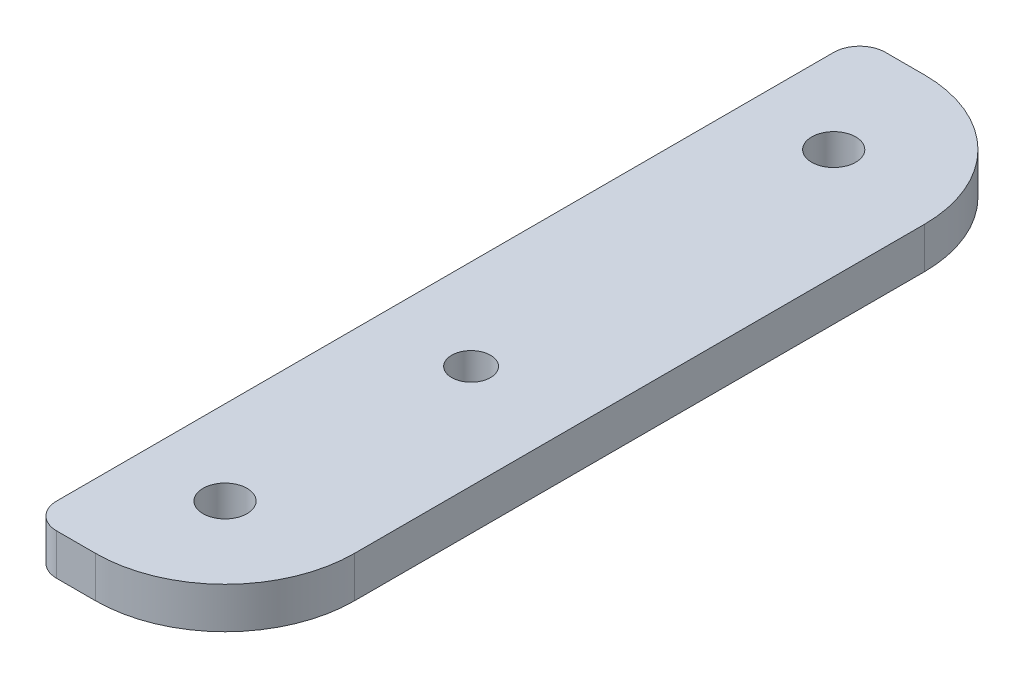
ISO-10303-21;
HEADER;
FILE_DESCRIPTION(('STEP AP214'),'2;1');
FILE_NAME('part.step','',(''),(''),'','','');
FILE_SCHEMA(('AUTOMOTIVE_DESIGN { 1 0 10303 214 1 1 1 1 }'));
ENDSEC;
DATA;
#1=APPLICATION_CONTEXT('core data for automotive mechanical design processes');
#2=APPLICATION_PROTOCOL_DEFINITION('international standard','automotive_design',2000,#1);
#3=PRODUCT_CONTEXT('',#1,'mechanical');
#4=PRODUCT('Part','Part','',(#3));
#5=PRODUCT_RELATED_PRODUCT_CATEGORY('part','',(#4));
#6=PRODUCT_DEFINITION_FORMATION('','',#4);
#7=PRODUCT_DEFINITION_CONTEXT('part definition',#1,'design');
#8=PRODUCT_DEFINITION('design','',#6,#7);
#9=PRODUCT_DEFINITION_SHAPE('','',#8);
#10=(LENGTH_UNIT() NAMED_UNIT(*) SI_UNIT(.MILLI.,.METRE.));
#11=(NAMED_UNIT(*) PLANE_ANGLE_UNIT() SI_UNIT($,.RADIAN.));
#12=(NAMED_UNIT(*) SI_UNIT($,.STERADIAN.) SOLID_ANGLE_UNIT());
#13=UNCERTAINTY_MEASURE_WITH_UNIT(LENGTH_MEASURE(1.E-05),#10,'distance_accuracy_value','');
#14=(GEOMETRIC_REPRESENTATION_CONTEXT(3) GLOBAL_UNCERTAINTY_ASSIGNED_CONTEXT((#13)) GLOBAL_UNIT_ASSIGNED_CONTEXT((#10,
#11,#12)) REPRESENTATION_CONTEXT('',''));
#15=CARTESIAN_POINT('',(0.,0.,0.));
#16=DIRECTION('',(0.,0.,1.));
#17=DIRECTION('',(1.,0.,0.));
#18=AXIS2_PLACEMENT_3D('',#15,#16,#17);
#19=CARTESIAN_POINT('',(-22.,3.175,32.));
#20=DIRECTION('',(0.,0.,-1.));
#21=DIRECTION('',(-1.,0.,0.));
#22=AXIS2_PLACEMENT_3D('',#19,#20,#21);
#23=PLANE('',#22);
#24=DIRECTION('',(1.,0.,0.));
#25=VECTOR('',#24,1.);
#26=CARTESIAN_POINT('',(-22.,3.175,32.));
#27=LINE('',#26,#25);
#28=CARTESIAN_POINT('',(19.,3.175,32.));
#29=VERTEX_POINT('',#28);
#30=CARTESIAN_POINT('',(22.,3.175,32.));
#31=VERTEX_POINT('',#30);
#32=EDGE_CURVE('E117',#29,#31,#27,.T.);
#33=ORIENTED_EDGE('',*,*,#32,.F.);
#34=DIRECTION('',(0.,1.,0.));
#35=VECTOR('',#34,1.);
#36=CARTESIAN_POINT('',(19.,3.175,32.));
#37=LINE('',#36,#35);
#38=CARTESIAN_POINT('',(19.,0.,32.));
#39=VERTEX_POINT('',#38);
#40=EDGE_CURVE('E56',#29,#39,#37,.F.);
#41=ORIENTED_EDGE('',*,*,#40,.T.);
#42=DIRECTION('',(1.,0.,0.));
#43=VECTOR('',#42,1.);
#44=CARTESIAN_POINT('',(-22.,0.,32.));
#45=LINE('',#44,#43);
#46=CARTESIAN_POINT('',(22.,0.,32.));
#47=VERTEX_POINT('',#46);
#48=EDGE_CURVE('E109',#39,#47,#45,.T.);
#49=ORIENTED_EDGE('',*,*,#48,.T.);
#50=DIRECTION('',(0.,-1.,0.));
#51=VECTOR('',#50,1.);
#52=CARTESIAN_POINT('',(22.,3.175,32.));
#53=LINE('',#52,#51);
#54=EDGE_CURVE('E142',#31,#47,#53,.T.);
#55=ORIENTED_EDGE('',*,*,#54,.F.);
#56=EDGE_LOOP('',(#33,#41,#49,#55));
#57=FACE_BOUND('',#56,.T.);
#58=ADVANCED_FACE('F33',(#57),#23,.F.);
#59=CARTESIAN_POINT('',(22.,3.175,22.));
#60=DIRECTION('',(0.,-1.,0.));
#61=DIRECTION('',(0.,0.,-1.));
#62=AXIS2_PLACEMENT_3D('',#59,#60,#61);
#63=CYLINDRICAL_SURFACE('',#62,10.);
#64=CARTESIAN_POINT('',(22.,0.,22.));
#65=DIRECTION('',(0.,1.,0.));
#66=DIRECTION('',(0.,0.,1.));
#67=AXIS2_PLACEMENT_3D('',#64,#65,#66);
#68=CIRCLE('',#67,10.);
#69=CARTESIAN_POINT('',(32.,0.,22.));
#70=VERTEX_POINT('',#69);
#71=EDGE_CURVE('E138',#47,#70,#68,.T.);
#72=ORIENTED_EDGE('',*,*,#71,.T.);
#73=DIRECTION('',(0.,-1.,0.));
#74=VECTOR('',#73,1.);
#75=CARTESIAN_POINT('',(32.,3.175,22.));
#76=LINE('',#75,#74);
#77=CARTESIAN_POINT('',(32.,3.175,22.));
#78=VERTEX_POINT('',#77);
#79=EDGE_CURVE('E146',#78,#70,#76,.T.);
#80=ORIENTED_EDGE('',*,*,#79,.F.);
#81=CARTESIAN_POINT('',(22.,3.175,22.));
#82=DIRECTION('',(0.,1.,0.));
#83=DIRECTION('',(0.,0.,1.));
#84=AXIS2_PLACEMENT_3D('',#81,#82,#83);
#85=CIRCLE('',#84,10.);
#86=EDGE_CURVE('E125',#31,#78,#85,.T.);
#87=ORIENTED_EDGE('',*,*,#86,.F.);
#88=ORIENTED_EDGE('',*,*,#54,.T.);
#89=EDGE_LOOP('',(#72,#80,#87,#88));
#90=FACE_BOUND('',#89,.T.);
#91=ADVANCED_FACE('F178',(#90),#63,.T.);
#92=CARTESIAN_POINT('',(32.,3.175,-22.));
#93=DIRECTION('',(1.,0.,0.));
#94=DIRECTION('',(0.,0.,-1.));
#95=AXIS2_PLACEMENT_3D('',#92,#93,#94);
#96=PLANE('',#95);
#97=DIRECTION('',(0.,0.,1.));
#98=VECTOR('',#97,1.);
#99=CARTESIAN_POINT('',(32.,0.,-22.));
#100=LINE('',#99,#98);
#101=CARTESIAN_POINT('',(32.,0.,-22.));
#102=VERTEX_POINT('',#101);
#103=EDGE_CURVE('E135',#102,#70,#100,.T.);
#104=ORIENTED_EDGE('',*,*,#103,.F.);
#105=DIRECTION('',(0.,-1.,0.));
#106=VECTOR('',#105,1.);
#107=CARTESIAN_POINT('',(32.,3.175,-22.));
#108=LINE('',#107,#106);
#109=CARTESIAN_POINT('',(32.,3.175,-22.));
#110=VERTEX_POINT('',#109);
#111=EDGE_CURVE('E116',#110,#102,#108,.T.);
#112=ORIENTED_EDGE('',*,*,#111,.F.);
#113=DIRECTION('',(0.,0.,1.));
#114=VECTOR('',#113,1.);
#115=CARTESIAN_POINT('',(32.,3.175,-22.));
#116=LINE('',#115,#114);
#117=EDGE_CURVE('E123',#110,#78,#116,.T.);
#118=ORIENTED_EDGE('',*,*,#117,.T.);
#119=ORIENTED_EDGE('',*,*,#79,.T.);
#120=EDGE_LOOP('',(#104,#112,#118,#119));
#121=FACE_BOUND('',#120,.T.);
#122=ADVANCED_FACE('F181',(#121),#96,.T.);
#123=CARTESIAN_POINT('',(22.,3.175,-22.));
#124=DIRECTION('',(0.,-1.,0.));
#125=DIRECTION('',(0.,0.,-1.));
#126=AXIS2_PLACEMENT_3D('',#123,#124,#125);
#127=CYLINDRICAL_SURFACE('',#126,10.);
#128=CARTESIAN_POINT('',(22.,0.,-22.));
#129=DIRECTION('',(0.,-1.,0.));
#130=DIRECTION('',(0.,0.,-1.));
#131=AXIS2_PLACEMENT_3D('',#128,#129,#130);
#132=CIRCLE('',#131,10.);
#133=CARTESIAN_POINT('',(22.,0.,-32.));
#134=VERTEX_POINT('',#133);
#135=EDGE_CURVE('E115',#134,#102,#132,.T.);
#136=ORIENTED_EDGE('',*,*,#135,.F.);
#137=DIRECTION('',(0.,-1.,0.));
#138=VECTOR('',#137,1.);
#139=CARTESIAN_POINT('',(22.,3.175,-32.));
#140=LINE('',#139,#138);
#141=CARTESIAN_POINT('',(22.,3.175,-32.));
#142=VERTEX_POINT('',#141);
#143=EDGE_CURVE('E103',#142,#134,#140,.T.);
#144=ORIENTED_EDGE('',*,*,#143,.F.);
#145=CARTESIAN_POINT('',(22.,3.175,-22.));
#146=DIRECTION('',(0.,-1.,0.));
#147=DIRECTION('',(0.,0.,-1.));
#148=AXIS2_PLACEMENT_3D('',#145,#146,#147);
#149=CIRCLE('',#148,10.);
#150=EDGE_CURVE('E108',#142,#110,#149,.T.);
#151=ORIENTED_EDGE('',*,*,#150,.T.);
#152=ORIENTED_EDGE('',*,*,#111,.T.);
#153=EDGE_LOOP('',(#136,#144,#151,#152));
#154=FACE_BOUND('',#153,.T.);
#155=ADVANCED_FACE('F113',(#154),#127,.T.);
#156=CARTESIAN_POINT('',(-22.,3.175,-32.));
#157=DIRECTION('',(0.,0.,-1.));
#158=DIRECTION('',(-1.,0.,0.));
#159=AXIS2_PLACEMENT_3D('',#156,#157,#158);
#160=PLANE('',#159);
#161=DIRECTION('',(1.,0.,0.));
#162=VECTOR('',#161,1.);
#163=CARTESIAN_POINT('',(-22.,0.,-32.));
#164=LINE('',#163,#162);
#165=CARTESIAN_POINT('',(19.,0.,-32.));
#166=VERTEX_POINT('',#165);
#167=EDGE_CURVE('E131',#166,#134,#164,.T.);
#168=ORIENTED_EDGE('',*,*,#167,.F.);
#169=DIRECTION('',(0.,1.,0.));
#170=VECTOR('',#169,1.);
#171=CARTESIAN_POINT('',(19.,3.175,-32.));
#172=LINE('',#171,#170);
#173=CARTESIAN_POINT('',(19.,3.175,-32.));
#174=VERTEX_POINT('',#173);
#175=EDGE_CURVE('E11',#166,#174,#172,.T.);
#176=ORIENTED_EDGE('',*,*,#175,.T.);
#177=DIRECTION('',(1.,0.,0.));
#178=VECTOR('',#177,1.);
#179=CARTESIAN_POINT('',(-22.,3.175,-32.));
#180=LINE('',#179,#178);
#181=EDGE_CURVE('E100',#174,#142,#180,.T.);
#182=ORIENTED_EDGE('',*,*,#181,.T.);
#183=ORIENTED_EDGE('',*,*,#143,.T.);
#184=EDGE_LOOP('',(#168,#176,#182,#183));
#185=FACE_BOUND('',#184,.T.);
#186=ADVANCED_FACE('F102',(#185),#160,.T.);
#187=CARTESIAN_POINT('',(-22.,3.175,-22.));
#188=DIRECTION('',(0.,-1.,0.));
#189=DIRECTION('',(0.,0.,-1.));
#190=AXIS2_PLACEMENT_3D('',#187,#188,#189);
#191=PLANE('',#190);
#192=CARTESIAN_POINT('',(24.,3.175,5.));
#193=DIRECTION('',(0.,1.,0.));
#194=DIRECTION('',(0.,0.,1.));
#195=AXIS2_PLACEMENT_3D('',#192,#193,#194);
#196=CIRCLE('',#195,1.5);
#197=CARTESIAN_POINT('',(24.,3.175,6.5));
#198=VERTEX_POINT('',#197);
#199=EDGE_CURVE('E170',#198,#198,#196,.T.);
#200=ORIENTED_EDGE('',*,*,#199,.F.);
#201=EDGE_LOOP('',(#200));
#202=FACE_BOUND('',#201,.T.);
#203=CARTESIAN_POINT('',(23.5,3.175,-23.5));
#204=DIRECTION('',(0.,1.,0.));
#205=DIRECTION('',(0.,0.,1.));
#206=AXIS2_PLACEMENT_3D('',#203,#204,#205);
#207=CIRCLE('',#206,1.7);
#208=CARTESIAN_POINT('',(23.5,3.175,-21.8));
#209=VERTEX_POINT('',#208);
#210=EDGE_CURVE('E193',#209,#209,#207,.T.);
#211=ORIENTED_EDGE('',*,*,#210,.F.);
#212=EDGE_LOOP('',(#211));
#213=FACE_BOUND('',#212,.T.);
#214=CARTESIAN_POINT('',(23.5,3.175,23.5));
#215=DIRECTION('',(0.,1.,0.));
#216=DIRECTION('',(0.,0.,1.));
#217=AXIS2_PLACEMENT_3D('',#214,#215,#216);
#218=CIRCLE('',#217,1.7);
#219=CARTESIAN_POINT('',(23.5,3.175,25.2));
#220=VERTEX_POINT('',#219);
#221=EDGE_CURVE('E188',#220,#220,#218,.T.);
#222=ORIENTED_EDGE('',*,*,#221,.F.);
#223=EDGE_LOOP('',(#222));
#224=FACE_BOUND('',#223,.T.);
#225=DIRECTION('',(0.,0.,-1.));
#226=VECTOR('',#225,1.);
#227=CARTESIAN_POINT('',(17.,3.175,32.));
#228=LINE('',#227,#226);
#229=CARTESIAN_POINT('',(17.,3.175,30.));
#230=VERTEX_POINT('',#229);
#231=CARTESIAN_POINT('',(17.,3.175,-30.));
#232=VERTEX_POINT('',#231);
#233=EDGE_CURVE('E171',#230,#232,#228,.T.);
#234=ORIENTED_EDGE('',*,*,#233,.F.);
#235=CARTESIAN_POINT('',(19.,3.175,30.));
#236=DIRECTION('',(0.,-1.,0.));
#237=DIRECTION('',(0.,0.,-1.));
#238=AXIS2_PLACEMENT_3D('',#235,#236,#237);
#239=CIRCLE('',#238,2.);
#240=EDGE_CURVE('E155',#230,#29,#239,.F.);
#241=ORIENTED_EDGE('',*,*,#240,.T.);
#242=ORIENTED_EDGE('',*,*,#32,.T.);
#243=ORIENTED_EDGE('',*,*,#86,.T.);
#244=ORIENTED_EDGE('',*,*,#117,.F.);
#245=ORIENTED_EDGE('',*,*,#150,.F.);
#246=ORIENTED_EDGE('',*,*,#181,.F.);
#247=CARTESIAN_POINT('',(19.,3.175,-30.));
#248=DIRECTION('',(0.,-1.,0.));
#249=DIRECTION('',(0.,0.,-1.));
#250=AXIS2_PLACEMENT_3D('',#247,#248,#249);
#251=CIRCLE('',#250,2.);
#252=EDGE_CURVE('E153',#174,#232,#251,.F.);
#253=ORIENTED_EDGE('',*,*,#252,.T.);
#254=EDGE_LOOP('',(#234,#241,#242,#243,#244,#245,#246,#253));
#255=FACE_BOUND('',#254,.T.);
#256=ADVANCED_FACE('F121',(#202,#213,#224,#255),#191,.F.);
#257=CARTESIAN_POINT('',(-22.,0.,-22.));
#258=DIRECTION('',(0.,-1.,0.));
#259=DIRECTION('',(0.,0.,-1.));
#260=AXIS2_PLACEMENT_3D('',#257,#258,#259);
#261=PLANE('',#260);
#262=ORIENTED_EDGE('',*,*,#48,.F.);
#263=CARTESIAN_POINT('',(19.,0.,30.));
#264=DIRECTION('',(0.,-1.,0.));
#265=DIRECTION('',(0.,0.,-1.));
#266=AXIS2_PLACEMENT_3D('',#263,#264,#265);
#267=CIRCLE('',#266,2.);
#268=CARTESIAN_POINT('',(17.,0.,30.));
#269=VERTEX_POINT('',#268);
#270=EDGE_CURVE('E41',#39,#269,#267,.T.);
#271=ORIENTED_EDGE('',*,*,#270,.T.);
#272=DIRECTION('',(0.,0.,-1.));
#273=VECTOR('',#272,1.);
#274=CARTESIAN_POINT('',(17.,0.,32.));
#275=LINE('',#274,#273);
#276=CARTESIAN_POINT('',(17.,0.,-30.));
#277=VERTEX_POINT('',#276);
#278=EDGE_CURVE('E162',#269,#277,#275,.T.);
#279=ORIENTED_EDGE('',*,*,#278,.T.);
#280=CARTESIAN_POINT('',(19.,0.,-30.));
#281=DIRECTION('',(0.,-1.,0.));
#282=DIRECTION('',(0.,0.,-1.));
#283=AXIS2_PLACEMENT_3D('',#280,#281,#282);
#284=CIRCLE('',#283,2.);
#285=EDGE_CURVE('E48',#277,#166,#284,.T.);
#286=ORIENTED_EDGE('',*,*,#285,.T.);
#287=ORIENTED_EDGE('',*,*,#167,.T.);
#288=ORIENTED_EDGE('',*,*,#135,.T.);
#289=ORIENTED_EDGE('',*,*,#103,.T.);
#290=ORIENTED_EDGE('',*,*,#71,.F.);
#291=EDGE_LOOP('',(#262,#271,#279,#286,#287,#288,#289,#290));
#292=FACE_BOUND('',#291,.T.);
#293=CARTESIAN_POINT('',(24.,0.,5.));
#294=DIRECTION('',(0.,1.,0.));
#295=DIRECTION('',(0.,0.,1.));
#296=AXIS2_PLACEMENT_3D('',#293,#294,#295);
#297=CIRCLE('',#296,1.5);
#298=CARTESIAN_POINT('',(24.,0.,6.5));
#299=VERTEX_POINT('',#298);
#300=EDGE_CURVE('E185',#299,#299,#297,.T.);
#301=ORIENTED_EDGE('',*,*,#300,.T.);
#302=EDGE_LOOP('',(#301));
#303=FACE_BOUND('',#302,.T.);
#304=CARTESIAN_POINT('',(23.5,0.,-23.5));
#305=DIRECTION('',(0.,1.,0.));
#306=DIRECTION('',(0.,0.,1.));
#307=AXIS2_PLACEMENT_3D('',#304,#305,#306);
#308=CIRCLE('',#307,1.7);
#309=CARTESIAN_POINT('',(23.5,0.,-21.8));
#310=VERTEX_POINT('',#309);
#311=EDGE_CURVE('E133',#310,#310,#308,.T.);
#312=ORIENTED_EDGE('',*,*,#311,.T.);
#313=EDGE_LOOP('',(#312));
#314=FACE_BOUND('',#313,.T.);
#315=CARTESIAN_POINT('',(23.5,0.,23.5));
#316=DIRECTION('',(0.,1.,0.));
#317=DIRECTION('',(0.,0.,1.));
#318=AXIS2_PLACEMENT_3D('',#315,#316,#317);
#319=CIRCLE('',#318,1.7);
#320=CARTESIAN_POINT('',(23.5,0.,25.2));
#321=VERTEX_POINT('',#320);
#322=EDGE_CURVE('E196',#321,#321,#319,.T.);
#323=ORIENTED_EDGE('',*,*,#322,.T.);
#324=EDGE_LOOP('',(#323));
#325=FACE_BOUND('',#324,.T.);
#326=ADVANCED_FACE('F160',(#292,#303,#314,#325),#261,.T.);
#327=CARTESIAN_POINT('',(23.5,0.,23.5));
#328=DIRECTION('',(0.,1.,0.));
#329=DIRECTION('',(0.,0.,1.));
#330=AXIS2_PLACEMENT_3D('',#327,#328,#329);
#331=CYLINDRICAL_SURFACE('',#330,1.7);
#332=ORIENTED_EDGE('',*,*,#322,.F.);
#333=EDGE_LOOP('',(#332));
#334=FACE_BOUND('',#333,.T.);
#335=ORIENTED_EDGE('',*,*,#221,.T.);
#336=EDGE_LOOP('',(#335));
#337=FACE_BOUND('',#336,.T.);
#338=ADVANCED_FACE('F201',(#334,#337),#331,.F.);
#339=CARTESIAN_POINT('',(23.5,0.,-23.5));
#340=DIRECTION('',(0.,1.,0.));
#341=DIRECTION('',(0.,0.,1.));
#342=AXIS2_PLACEMENT_3D('',#339,#340,#341);
#343=CYLINDRICAL_SURFACE('',#342,1.7);
#344=ORIENTED_EDGE('',*,*,#311,.F.);
#345=EDGE_LOOP('',(#344));
#346=FACE_BOUND('',#345,.T.);
#347=ORIENTED_EDGE('',*,*,#210,.T.);
#348=EDGE_LOOP('',(#347));
#349=FACE_BOUND('',#348,.T.);
#350=ADVANCED_FACE('F235',(#346,#349),#343,.F.);
#351=CARTESIAN_POINT('',(24.,0.,5.));
#352=DIRECTION('',(0.,1.,0.));
#353=DIRECTION('',(0.,0.,1.));
#354=AXIS2_PLACEMENT_3D('',#351,#352,#353);
#355=CYLINDRICAL_SURFACE('',#354,1.5);
#356=ORIENTED_EDGE('',*,*,#300,.F.);
#357=EDGE_LOOP('',(#356));
#358=FACE_BOUND('',#357,.T.);
#359=ORIENTED_EDGE('',*,*,#199,.T.);
#360=EDGE_LOOP('',(#359));
#361=FACE_BOUND('',#360,.T.);
#362=ADVANCED_FACE('F230',(#358,#361),#355,.F.);
#363=CARTESIAN_POINT('',(17.,0.,32.));
#364=DIRECTION('',(1.,0.,0.));
#365=DIRECTION('',(0.,0.,-1.));
#366=AXIS2_PLACEMENT_3D('',#363,#364,#365);
#367=PLANE('',#366);
#368=ORIENTED_EDGE('',*,*,#278,.F.);
#369=DIRECTION('',(0.,1.,0.));
#370=VECTOR('',#369,1.);
#371=CARTESIAN_POINT('',(17.,0.,30.));
#372=LINE('',#371,#370);
#373=EDGE_CURVE('E150',#269,#230,#372,.T.);
#374=ORIENTED_EDGE('',*,*,#373,.T.);
#375=ORIENTED_EDGE('',*,*,#233,.T.);
#376=DIRECTION('',(0.,1.,0.));
#377=VECTOR('',#376,1.);
#378=CARTESIAN_POINT('',(17.,0.,-30.));
#379=LINE('',#378,#377);
#380=EDGE_CURVE('E145',#232,#277,#379,.F.);
#381=ORIENTED_EDGE('',*,*,#380,.T.);
#382=EDGE_LOOP('',(#368,#374,#375,#381));
#383=FACE_BOUND('',#382,.T.);
#384=ADVANCED_FACE('F167',(#383),#367,.F.);
#385=CARTESIAN_POINT('',(19.,0.,30.));
#386=DIRECTION('',(0.,1.,0.));
#387=DIRECTION('',(0.,0.,1.));
#388=AXIS2_PLACEMENT_3D('',#385,#386,#387);
#389=CYLINDRICAL_SURFACE('',#388,2.);
#390=ORIENTED_EDGE('',*,*,#270,.F.);
#391=ORIENTED_EDGE('',*,*,#40,.F.);
#392=ORIENTED_EDGE('',*,*,#240,.F.);
#393=ORIENTED_EDGE('',*,*,#373,.F.);
#394=EDGE_LOOP('',(#390,#391,#392,#393));
#395=FACE_BOUND('',#394,.T.);
#396=ADVANCED_FACE('F173',(#395),#389,.T.);
#397=CARTESIAN_POINT('',(19.,3.175,-30.));
#398=DIRECTION('',(0.,-1.,0.));
#399=DIRECTION('',(0.,0.,-1.));
#400=AXIS2_PLACEMENT_3D('',#397,#398,#399);
#401=CYLINDRICAL_SURFACE('',#400,2.);
#402=ORIENTED_EDGE('',*,*,#285,.F.);
#403=ORIENTED_EDGE('',*,*,#380,.F.);
#404=ORIENTED_EDGE('',*,*,#252,.F.);
#405=ORIENTED_EDGE('',*,*,#175,.F.);
#406=EDGE_LOOP('',(#402,#403,#404,#405));
#407=FACE_BOUND('',#406,.T.);
#408=ADVANCED_FACE('F35',(#407),#401,.T.);
#409=CLOSED_SHELL('',(#58,#91,#122,#155,#186,#256,#326,#338,#350,#362,#384,#396,#408));
#410=MANIFOLD_SOLID_BREP('B2',#409);
#411=ADVANCED_BREP_SHAPE_REPRESENTATION('',(#18,#410),#14);
#412=SHAPE_DEFINITION_REPRESENTATION(#9,#411);
ENDSEC;
END-ISO-10303-21;
